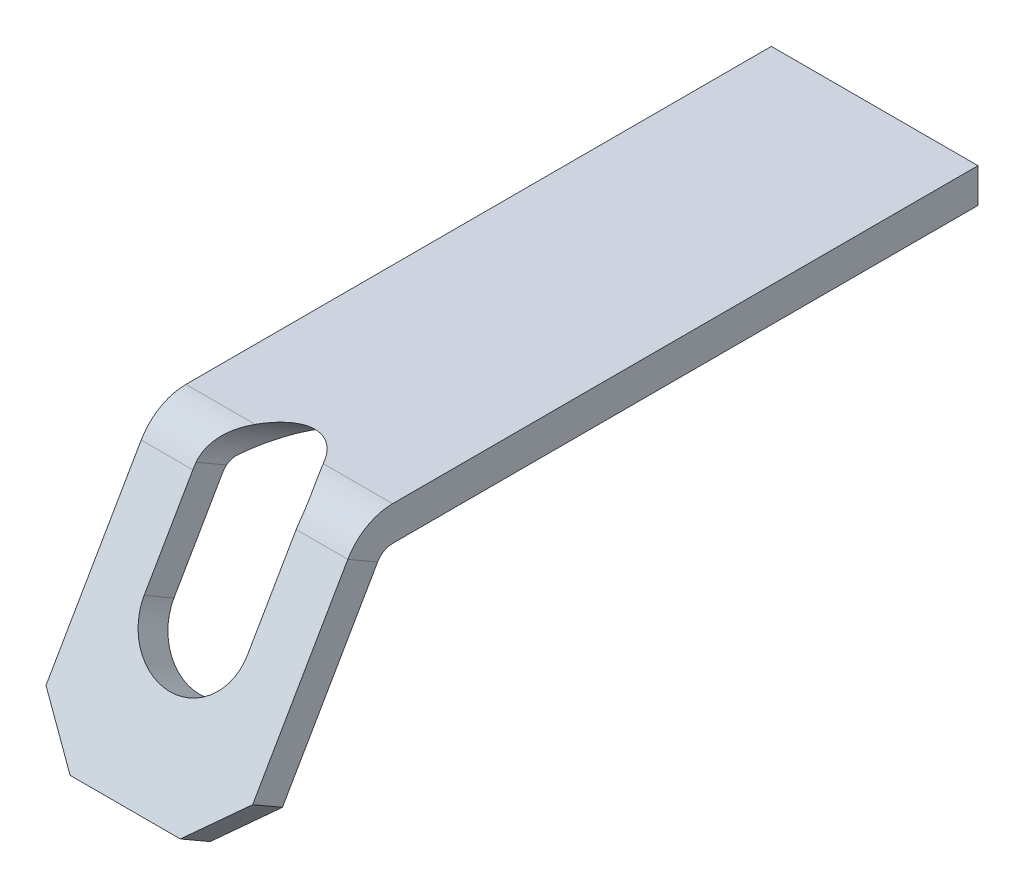
ISO-10303-21;
HEADER;
FILE_DESCRIPTION(('STEP AP214'),'2;1');
FILE_NAME('part.step','',(''),(''),'','','');
FILE_SCHEMA(('AUTOMOTIVE_DESIGN { 1 0 10303 214 1 1 1 1 }'));
ENDSEC;
DATA;
#1=APPLICATION_CONTEXT('core data for automotive mechanical design processes');
#2=APPLICATION_PROTOCOL_DEFINITION('international standard','automotive_design',2000,#1);
#3=PRODUCT_CONTEXT('',#1,'mechanical');
#4=PRODUCT('Part','Part','',(#3));
#5=PRODUCT_RELATED_PRODUCT_CATEGORY('part','',(#4));
#6=PRODUCT_DEFINITION_FORMATION('','',#4);
#7=PRODUCT_DEFINITION_CONTEXT('part definition',#1,'design');
#8=PRODUCT_DEFINITION('design','',#6,#7);
#9=PRODUCT_DEFINITION_SHAPE('','',#8);
#10=(LENGTH_UNIT() NAMED_UNIT(*) SI_UNIT(.MILLI.,.METRE.));
#11=(NAMED_UNIT(*) PLANE_ANGLE_UNIT() SI_UNIT($,.RADIAN.));
#12=(NAMED_UNIT(*) SI_UNIT($,.STERADIAN.) SOLID_ANGLE_UNIT());
#13=UNCERTAINTY_MEASURE_WITH_UNIT(LENGTH_MEASURE(1.E-05),#10,'distance_accuracy_value','');
#14=(GEOMETRIC_REPRESENTATION_CONTEXT(3) GLOBAL_UNCERTAINTY_ASSIGNED_CONTEXT((#13)) GLOBAL_UNIT_ASSIGNED_CONTEXT((#10,
#11,#12)) REPRESENTATION_CONTEXT('',''));
#15=CARTESIAN_POINT('',(0.,0.,0.));
#16=DIRECTION('',(0.,0.,1.));
#17=DIRECTION('',(1.,0.,0.));
#18=AXIS2_PLACEMENT_3D('',#15,#16,#17);
#19=CARTESIAN_POINT('',(0.,-0.5,4.25));
#20=DIRECTION('',(1.,0.,0.));
#21=DIRECTION('',(0.,0.,-1.));
#22=AXIS2_PLACEMENT_3D('',#19,#20,#21);
#23=CYLINDRICAL_SURFACE('',#22,0.25);
#24=CARTESIAN_POINT('',(0.738540154084688,-0.25,4.25));
#25=CARTESIAN_POINT('',(0.739796227190586,-0.249992222476748,4.26423192600012));
#26=CARTESIAN_POINT('',(0.741136393695474,-0.251215674942695,4.27845228618072));
#27=CARTESIAN_POINT('',(0.743704492818735,-0.255982139403662,4.30608304503192));
#28=CARTESIAN_POINT('',(0.74493454642555,-0.2594573169147,4.31950497559517));
#29=CARTESIAN_POINT('',(0.747172335123278,-0.268891956089954,4.34646595481917));
#30=CARTESIAN_POINT('',(0.748160348429003,-0.274998607282581,4.35995559261057));
#31=CARTESIAN_POINT('',(0.749588900459598,-0.289725386987503,4.38608332336731));
#32=CARTESIAN_POINT('',(0.750011148585141,-0.298418856822308,4.3986810266524));
#33=CARTESIAN_POINT('',(0.75,-0.308220009215909,4.41037591818866));
#34=B_SPLINE_CURVE_WITH_KNOTS('',3,(#24,#25,#26,#27,#28,#29,#30,#31,#32,#33),.UNSPECIFIED.,.F.,
.F.,(4,2,2,2,4),(0.,0.0428026914059938,0.0843723717900828,0.128652135829097,0.174331417159321),.UNSPECIFIED.);
#35=CARTESIAN_POINT('',(0.738540154084688,-0.25,4.25));
#36=VERTEX_POINT('',#35);
#37=CARTESIAN_POINT('',(0.75,-0.308220009215908,4.41037591818866));
#38=VERTEX_POINT('',#37);
#39=EDGE_CURVE('E317',#36,#38,#34,.T.);
#40=ORIENTED_EDGE('',*,*,#39,.F.);
#41=DIRECTION('',(1.,0.,0.));
#42=VECTOR('',#41,1.);
#43=CARTESIAN_POINT('',(-1.5,-0.25,4.25));
#44=LINE('',#43,#42);
#45=CARTESIAN_POINT('',(1.5,-0.25,4.25));
#46=VERTEX_POINT('',#45);
#47=EDGE_CURVE('E316',#36,#46,#44,.T.);
#48=ORIENTED_EDGE('',*,*,#47,.T.);
#49=CARTESIAN_POINT('',(1.5,-0.5,4.25));
#50=DIRECTION('',(1.,0.,0.));
#51=DIRECTION('',(0.,1.,0.));
#52=AXIS2_PLACEMENT_3D('',#49,#50,#51);
#53=CIRCLE('',#52,0.25);
#54=CARTESIAN_POINT('',(1.5,-0.375,4.46650635094611));
#55=VERTEX_POINT('',#54);
#56=EDGE_CURVE('E343',#46,#55,#53,.T.);
#57=ORIENTED_EDGE('',*,*,#56,.T.);
#58=DIRECTION('',(1.,0.,0.));
#59=VECTOR('',#58,1.);
#60=CARTESIAN_POINT('',(-1.5,-0.375,4.46650635094611));
#61=LINE('',#60,#59);
#62=CARTESIAN_POINT('',(0.75,-0.375,4.46650635094611));
#63=VERTEX_POINT('',#62);
#64=EDGE_CURVE('E332',#63,#55,#61,.T.);
#65=ORIENTED_EDGE('',*,*,#64,.F.);
#66=CARTESIAN_POINT('',(0.75,-0.5,4.25));
#67=DIRECTION('',(1.,0.,0.));
#68=DIRECTION('',(0.,0.,-1.));
#69=AXIS2_PLACEMENT_3D('',#66,#67,#68);
#70=CIRCLE('',#69,0.25);
#71=EDGE_CURVE('E203',#38,#63,#70,.T.);
#72=ORIENTED_EDGE('',*,*,#71,.F.);
#73=EDGE_LOOP('',(#40,#48,#57,#65,#72));
#74=FACE_BOUND('',#73,.T.);
#75=ADVANCED_FACE('F32',(#74),#23,.F.);
#76=CARTESIAN_POINT('',(0.,-0.5,4.25));
#77=DIRECTION('',(1.,0.,0.));
#78=DIRECTION('',(0.,0.,-1.));
#79=AXIS2_PLACEMENT_3D('',#76,#77,#78);
#80=CYLINDRICAL_SURFACE('',#79,0.75);
#81=CARTESIAN_POINT('',(0.75,-0.0530774463347981,4.85229580027208));
#82=CARTESIAN_POINT('',(0.750002475309161,-0.0390500007812527,4.84189012408484));
#83=CARTESIAN_POINT('',(0.749397484850658,-0.0253996458115997,4.83099771523583));
#84=CARTESIAN_POINT('',(0.747030547301498,0.00104006971930772,4.8083555069125));
#85=CARTESIAN_POINT('',(0.745269813605595,0.0138303177827564,4.79660661812892));
#86=CARTESIAN_POINT('',(0.738388136393959,0.0505308719127275,4.7604737016062));
#87=CARTESIAN_POINT('',(0.731665075692414,0.0730740166895009,4.73497676608455));
#88=CARTESIAN_POINT('',(0.714670479663492,0.113924752364809,4.68210224166803));
#89=CARTESIAN_POINT('',(0.704412929418581,0.132248568388786,4.65473240041221));
#90=CARTESIAN_POINT('',(0.681092480512217,0.164811508788652,4.59868326911695));
#91=CARTESIAN_POINT('',(0.668020265449992,0.179036692146175,4.56999988576025));
#92=CARTESIAN_POINT('',(0.63361768347433,0.2088635379017,4.49914580377907));
#93=CARTESIAN_POINT('',(0.611187373419911,0.222307050936848,4.45660414355653));
#94=CARTESIAN_POINT('',(0.564129396140941,0.241456718121171,4.37110856302409));
#95=CARTESIAN_POINT('',(0.539503361307708,0.247168570016325,4.3281549698181));
#96=CARTESIAN_POINT('',(0.508168812013807,0.249724148600028,4.27340370863223));
#97=CARTESIAN_POINT('',(0.501476538124168,0.249996949131605,4.26170462495713));
#98=CARTESIAN_POINT('',(0.494804752028709,0.250000000000006,4.25));
#99=B_SPLINE_CURVE_WITH_KNOTS('',3,(#81,#82,#83,#84,#85,#86,#87,#88,#89,#90,#91,#92,#93,#94,#95,
#96,#97,#98),.UNSPECIFIED.,.F.,.F.,(4,2,2,2,2,2,2,2,4),(0.,0.0523524240966635,0.104649972016483,
0.208128032232243,0.311201270134959,0.4146210689264,0.563636486235141,0.712542028697262,
0.752971410406567),.UNSPECIFIED.);
#100=CARTESIAN_POINT('',(0.75,-0.0530774463347985,4.85229580027207));
#101=VERTEX_POINT('',#100);
#102=CARTESIAN_POINT('',(0.494804752028707,0.25,4.25));
#103=VERTEX_POINT('',#102);
#104=EDGE_CURVE('E242',#101,#103,#99,.T.);
#105=ORIENTED_EDGE('',*,*,#104,.F.);
#106=CARTESIAN_POINT('',(0.75,-0.5,4.25));
#107=DIRECTION('',(1.,0.,0.));
#108=DIRECTION('',(0.,0.,-1.));
#109=AXIS2_PLACEMENT_3D('',#106,#107,#108);
#110=CIRCLE('',#109,0.75);
#111=CARTESIAN_POINT('',(0.75,-0.125000000000001,4.89951905283833));
#112=VERTEX_POINT('',#111);
#113=EDGE_CURVE('E205',#112,#101,#110,.F.);
#114=ORIENTED_EDGE('',*,*,#113,.F.);
#115=DIRECTION('',(-1.,0.,0.));
#116=VECTOR('',#115,1.);
#117=CARTESIAN_POINT('',(1.5,-0.125000000000001,4.89951905283833));
#118=LINE('',#117,#116);
#119=CARTESIAN_POINT('',(1.5,-0.125000000000001,4.89951905283833));
#120=VERTEX_POINT('',#119);
#121=EDGE_CURVE('E340',#120,#112,#118,.T.);
#122=ORIENTED_EDGE('',*,*,#121,.F.);
#123=CARTESIAN_POINT('',(1.5,-0.5,4.25));
#124=DIRECTION('',(1.,0.,0.));
#125=DIRECTION('',(0.,1.,0.));
#126=AXIS2_PLACEMENT_3D('',#123,#124,#125);
#127=CIRCLE('',#126,0.75);
#128=CARTESIAN_POINT('',(1.5,0.25,4.25));
#129=VERTEX_POINT('',#128);
#130=EDGE_CURVE('E354',#129,#120,#127,.T.);
#131=ORIENTED_EDGE('',*,*,#130,.F.);
#132=DIRECTION('',(1.,0.,0.));
#133=VECTOR('',#132,1.);
#134=CARTESIAN_POINT('',(-1.5,0.25,4.25));
#135=LINE('',#134,#133);
#136=EDGE_CURVE('E371',#103,#129,#135,.T.);
#137=ORIENTED_EDGE('',*,*,#136,.F.);
#138=EDGE_LOOP('',(#105,#114,#122,#131,#137));
#139=FACE_BOUND('',#138,.T.);
#140=ADVANCED_FACE('F256',(#139),#80,.T.);
#141=CARTESIAN_POINT('',(1.5,0.25,-4.25));
#142=DIRECTION('',(-1.,0.,0.));
#143=DIRECTION('',(0.,0.,1.));
#144=AXIS2_PLACEMENT_3D('',#141,#142,#143);
#145=PLANE('',#144);
#146=DIRECTION('',(0.,0.,-1.));
#147=VECTOR('',#146,1.);
#148=CARTESIAN_POINT('',(1.5,-0.25,-4.25));
#149=LINE('',#148,#147);
#150=CARTESIAN_POINT('',(1.5,-0.25,-4.25));
#151=VERTEX_POINT('',#150);
#152=EDGE_CURVE('E363',#46,#151,#149,.T.);
#153=ORIENTED_EDGE('',*,*,#152,.T.);
#154=DIRECTION('',(0.,-1.,0.));
#155=VECTOR('',#154,1.);
#156=CARTESIAN_POINT('',(1.5,0.25,-4.25));
#157=LINE('',#156,#155);
#158=CARTESIAN_POINT('',(1.5,0.25,-4.25));
#159=VERTEX_POINT('',#158);
#160=EDGE_CURVE('E181',#159,#151,#157,.T.);
#161=ORIENTED_EDGE('',*,*,#160,.F.);
#162=DIRECTION('',(0.,0.,-1.));
#163=VECTOR('',#162,1.);
#164=CARTESIAN_POINT('',(1.5,0.25,-4.25));
#165=LINE('',#164,#163);
#166=EDGE_CURVE('E364',#129,#159,#165,.T.);
#167=ORIENTED_EDGE('',*,*,#166,.F.);
#168=ORIENTED_EDGE('',*,*,#130,.T.);
#169=DIRECTION('',(0.,0.5,0.866025403784439));
#170=VECTOR('',#169,1.);
#171=CARTESIAN_POINT('',(1.5,-0.375,4.46650635094611));
#172=LINE('',#171,#170);
#173=EDGE_CURVE('E346',#55,#120,#172,.T.);
#174=ORIENTED_EDGE('',*,*,#173,.F.);
#175=ORIENTED_EDGE('',*,*,#56,.F.);
#176=EDGE_LOOP('',(#153,#161,#167,#168,#174,#175));
#177=FACE_BOUND('',#176,.T.);
#178=ADVANCED_FACE('F279',(#177),#145,.F.);
#179=CARTESIAN_POINT('',(-1.5,0.25,-4.25));
#180=DIRECTION('',(0.,0.,1.));
#181=DIRECTION('',(1.,0.,0.));
#182=AXIS2_PLACEMENT_3D('',#179,#180,#181);
#183=PLANE('',#182);
#184=DIRECTION('',(-1.,0.,0.));
#185=VECTOR('',#184,1.);
#186=CARTESIAN_POINT('',(-1.5,-0.25,-4.25));
#187=LINE('',#186,#185);
#188=CARTESIAN_POINT('',(-1.5,-0.25,-4.25));
#189=VERTEX_POINT('',#188);
#190=EDGE_CURVE('E378',#151,#189,#187,.T.);
#191=ORIENTED_EDGE('',*,*,#190,.T.);
#192=DIRECTION('',(0.,-1.,0.));
#193=VECTOR('',#192,1.);
#194=CARTESIAN_POINT('',(-1.5,0.25,-4.25));
#195=LINE('',#194,#193);
#196=CARTESIAN_POINT('',(-1.5,0.25,-4.25));
#197=VERTEX_POINT('',#196);
#198=EDGE_CURVE('E375',#197,#189,#195,.T.);
#199=ORIENTED_EDGE('',*,*,#198,.F.);
#200=DIRECTION('',(-1.,0.,0.));
#201=VECTOR('',#200,1.);
#202=CARTESIAN_POINT('',(-1.5,0.25,-4.25));
#203=LINE('',#202,#201);
#204=EDGE_CURVE('E367',#159,#197,#203,.T.);
#205=ORIENTED_EDGE('',*,*,#204,.F.);
#206=ORIENTED_EDGE('',*,*,#160,.T.);
#207=EDGE_LOOP('',(#191,#199,#205,#206));
#208=FACE_BOUND('',#207,.T.);
#209=ADVANCED_FACE('F275',(#208),#183,.F.);
#210=CARTESIAN_POINT('',(-1.5,0.25,-4.25));
#211=DIRECTION('',(1.,0.,0.));
#212=DIRECTION('',(0.,0.,-1.));
#213=AXIS2_PLACEMENT_3D('',#210,#211,#212);
#214=PLANE('',#213);
#215=DIRECTION('',(0.,0.,1.));
#216=VECTOR('',#215,1.);
#217=CARTESIAN_POINT('',(-1.5,-0.25,-4.25));
#218=LINE('',#217,#216);
#219=CARTESIAN_POINT('',(-1.5,-0.25,4.25));
#220=VERTEX_POINT('',#219);
#221=EDGE_CURVE('E380',#189,#220,#218,.T.);
#222=ORIENTED_EDGE('',*,*,#221,.T.);
#223=CARTESIAN_POINT('',(-1.5,-0.5,4.25));
#224=DIRECTION('',(1.,0.,0.));
#225=DIRECTION('',(0.,1.,0.));
#226=AXIS2_PLACEMENT_3D('',#223,#224,#225);
#227=CIRCLE('',#226,0.25);
#228=CARTESIAN_POINT('',(-1.5,-0.375,4.46650635094611));
#229=VERTEX_POINT('',#228);
#230=EDGE_CURVE('E330',#220,#229,#227,.T.);
#231=ORIENTED_EDGE('',*,*,#230,.T.);
#232=DIRECTION('',(0.,-0.5,-0.866025403784439));
#233=VECTOR('',#232,1.);
#234=CARTESIAN_POINT('',(-1.5,-0.125000000000001,4.89951905283833));
#235=LINE('',#234,#233);
#236=CARTESIAN_POINT('',(-1.5,-0.125000000000001,4.89951905283833));
#237=VERTEX_POINT('',#236);
#238=EDGE_CURVE('E321',#237,#229,#235,.T.);
#239=ORIENTED_EDGE('',*,*,#238,.F.);
#240=CARTESIAN_POINT('',(-1.5,-0.5,4.25));
#241=DIRECTION('',(1.,0.,0.));
#242=DIRECTION('',(0.,1.,0.));
#243=AXIS2_PLACEMENT_3D('',#240,#241,#242);
#244=CIRCLE('',#243,0.75);
#245=CARTESIAN_POINT('',(-1.5,0.25,4.25));
#246=VERTEX_POINT('',#245);
#247=EDGE_CURVE('E318',#246,#237,#244,.T.);
#248=ORIENTED_EDGE('',*,*,#247,.F.);
#249=DIRECTION('',(0.,0.,1.));
#250=VECTOR('',#249,1.);
#251=CARTESIAN_POINT('',(-1.5,0.25,-4.25));
#252=LINE('',#251,#250);
#253=EDGE_CURVE('E369',#197,#246,#252,.T.);
#254=ORIENTED_EDGE('',*,*,#253,.F.);
#255=ORIENTED_EDGE('',*,*,#198,.T.);
#256=EDGE_LOOP('',(#222,#231,#239,#248,#254,#255));
#257=FACE_BOUND('',#256,.T.);
#258=ADVANCED_FACE('F268',(#257),#214,.F.);
#259=CARTESIAN_POINT('',(0.,0.25,0.));
#260=DIRECTION('',(0.,1.,0.));
#261=DIRECTION('',(0.,0.,1.));
#262=AXIS2_PLACEMENT_3D('',#259,#260,#261);
#263=PLANE('',#262);
#264=CARTESIAN_POINT('',(0.,0.25,5.37724133595217));
#265=DIRECTION('',(0.,1.,0.));
#266=DIRECTION('',(0.,0.,1.));
#267=AXIS2_PLACEMENT_3D('',#264,#265,#266);
#268=ELLIPSE('',#267,1.5,0.75);
#269=CARTESIAN_POINT('',(-0.494804752028707,0.25,4.25));
#270=VERTEX_POINT('',#269);
#271=EDGE_CURVE('E207',#103,#270,#268,.T.);
#272=ORIENTED_EDGE('',*,*,#271,.F.);
#273=ORIENTED_EDGE('',*,*,#136,.T.);
#274=ORIENTED_EDGE('',*,*,#166,.T.);
#275=ORIENTED_EDGE('',*,*,#204,.T.);
#276=ORIENTED_EDGE('',*,*,#253,.T.);
#277=EDGE_CURVE('E372',#246,#270,#135,.T.);
#278=ORIENTED_EDGE('',*,*,#277,.T.);
#279=EDGE_LOOP('',(#272,#273,#274,#275,#276,#278));
#280=FACE_BOUND('',#279,.T.);
#281=ADVANCED_FACE('F265',(#280),#263,.T.);
#282=CARTESIAN_POINT('',(0.,-0.25,0.));
#283=DIRECTION('',(0.,1.,0.));
#284=DIRECTION('',(0.,0.,1.));
#285=AXIS2_PLACEMENT_3D('',#282,#283,#284);
#286=PLANE('',#285);
#287=ORIENTED_EDGE('',*,*,#47,.F.);
#288=CARTESIAN_POINT('',(0.,-0.25,4.51121593216774));
#289=DIRECTION('',(0.,1.,0.));
#290=DIRECTION('',(0.,0.,1.));
#291=AXIS2_PLACEMENT_3D('',#288,#289,#290);
#292=ELLIPSE('',#291,1.5,0.75);
#293=CARTESIAN_POINT('',(-0.738540154084688,-0.25,4.25));
#294=VERTEX_POINT('',#293);
#295=EDGE_CURVE('E217',#36,#294,#292,.T.);
#296=ORIENTED_EDGE('',*,*,#295,.T.);
#297=EDGE_CURVE('E309',#220,#294,#44,.T.);
#298=ORIENTED_EDGE('',*,*,#297,.F.);
#299=ORIENTED_EDGE('',*,*,#221,.F.);
#300=ORIENTED_EDGE('',*,*,#190,.F.);
#301=ORIENTED_EDGE('',*,*,#152,.F.);
#302=EDGE_LOOP('',(#287,#296,#298,#299,#300,#301));
#303=FACE_BOUND('',#302,.T.);
#304=ADVANCED_FACE('F261',(#303),#286,.F.);
#305=CARTESIAN_POINT('',(0.,-3.25,6.4150635094611));
#306=DIRECTION('',(0.,-0.866025403784438,0.500000000000001));
#307=DIRECTION('',(1.,0.,0.));
#308=AXIS2_PLACEMENT_3D('',#305,#306,#307);
#309=PLANE('',#308);
#310=DIRECTION('',(1.,0.,0.));
#311=VECTOR('',#310,1.);
#312=CARTESIAN_POINT('',(-1.5,-3.375,6.198557158515));
#313=LINE('',#312,#311);
#314=CARTESIAN_POINT('',(-0.799999999999998,-3.375,6.198557158515));
#315=VERTEX_POINT('',#314);
#316=CARTESIAN_POINT('',(0.8,-3.375,6.198557158515));
#317=VERTEX_POINT('',#316);
#318=EDGE_CURVE('E336',#315,#317,#313,.T.);
#319=ORIENTED_EDGE('',*,*,#318,.T.);
#320=DIRECTION('',(0.,0.500000000000001,0.866025403784438));
#321=VECTOR('',#320,1.);
#322=CARTESIAN_POINT('',(0.8,-3.25,6.4150635094611));
#323=LINE('',#322,#321);
#324=CARTESIAN_POINT('',(0.8,-3.125,6.63156986040721));
#325=VERTEX_POINT('',#324);
#326=EDGE_CURVE('E402',#317,#325,#323,.T.);
#327=ORIENTED_EDGE('',*,*,#326,.T.);
#328=DIRECTION('',(-1.,0.,0.));
#329=VECTOR('',#328,1.);
#330=CARTESIAN_POINT('',(1.5,-3.125,6.63156986040721));
#331=LINE('',#330,#329);
#332=CARTESIAN_POINT('',(-0.799999999999998,-3.125,6.63156986040721));
#333=VERTEX_POINT('',#332);
#334=EDGE_CURVE('E359',#325,#333,#331,.T.);
#335=ORIENTED_EDGE('',*,*,#334,.T.);
#336=DIRECTION('',(0.,-0.500000000000001,-0.866025403784438));
#337=VECTOR('',#336,1.);
#338=CARTESIAN_POINT('',(-0.799999999999998,-3.25,6.4150635094611));
#339=LINE('',#338,#337);
#340=EDGE_CURVE('E248',#333,#315,#339,.T.);
#341=ORIENTED_EDGE('',*,*,#340,.T.);
#342=EDGE_LOOP('',(#319,#327,#335,#341));
#343=FACE_BOUND('',#342,.T.);
#344=ADVANCED_FACE('F229',(#343),#309,.T.);
#345=CARTESIAN_POINT('',(-0.75,-0.308220009215908,4.41037591818866));
#346=CARTESIAN_POINT('',(-0.750008310530121,-0.299170345690206,4.39957110118343));
#347=CARTESIAN_POINT('',(-0.7496493719506,-0.291061551564701,4.38799997393136));
#348=CARTESIAN_POINT('',(-0.748415678099862,-0.277104423632904,4.36403100034418));
#349=CARTESIAN_POINT('',(-0.747555891577427,-0.271198332145317,4.35166604883466));
#350=CARTESIAN_POINT('',(-0.745421239101967,-0.261037124809497,4.32496342703673));
#351=CARTESIAN_POINT('',(-0.744115010283401,-0.256988760900442,4.31054949871758));
#352=CARTESIAN_POINT('',(-0.741355473168162,-0.25142101625551,4.28077071335262));
#353=CARTESIAN_POINT('',(-0.739898791250124,-0.249986913345264,4.26539018443887));
#354=CARTESIAN_POINT('',(-0.738540154084688,-0.25,4.25));
#355=B_SPLINE_CURVE_WITH_KNOTS('',3,(#345,#346,#347,#348,#349,#350,#351,#352,#353,#354),
.UNSPECIFIED.,.F.,.F.,(4,2,2,2,4),(0.,0.0422016336722642,0.0832023760305246,0.128047888733355,
0.174331752280167),.UNSPECIFIED.);
#356=CARTESIAN_POINT('',(-0.75,-0.308220009215908,4.41037591818866));
#357=VERTEX_POINT('',#356);
#358=EDGE_CURVE('E209',#357,#294,#355,.T.);
#359=ORIENTED_EDGE('',*,*,#358,.F.);
#360=CARTESIAN_POINT('',(-0.75,-0.5,4.25));
#361=DIRECTION('',(-1.,0.,0.));
#362=DIRECTION('',(0.,-1.,0.));
#363=AXIS2_PLACEMENT_3D('',#360,#361,#362);
#364=CIRCLE('',#363,0.25);
#365=CARTESIAN_POINT('',(-0.75,-0.375,4.46650635094611));
#366=VERTEX_POINT('',#365);
#367=EDGE_CURVE('E197',#366,#357,#364,.T.);
#368=ORIENTED_EDGE('',*,*,#367,.F.);
#369=EDGE_CURVE('E341',#229,#366,#61,.T.);
#370=ORIENTED_EDGE('',*,*,#369,.F.);
#371=ORIENTED_EDGE('',*,*,#230,.F.);
#372=ORIENTED_EDGE('',*,*,#297,.T.);
#373=EDGE_LOOP('',(#359,#368,#370,#371,#372));
#374=FACE_BOUND('',#373,.T.);
#375=ADVANCED_FACE('F219',(#374),#23,.F.);
#376=CARTESIAN_POINT('',(-0.494804752028707,0.25,4.25));
#377=CARTESIAN_POINT('',(-0.507212223849995,0.24999104936502,4.27176544478382));
#378=CARTESIAN_POINT('',(-0.519677329562981,0.249052174133644,4.29348153759597));
#379=CARTESIAN_POINT('',(-0.544476505895984,0.245273819176751,4.33686353730328));
#380=CARTESIAN_POINT('',(-0.556810364065535,0.242431628285439,4.35852932830796));
#381=CARTESIAN_POINT('',(-0.593492984985001,0.230897623169133,4.42397071088134));
#382=CARTESIAN_POINT('',(-0.617199549117097,0.219196023208876,4.46764754407431));
#383=CARTESIAN_POINT('',(-0.655369353049871,0.191156681794535,4.54326612847591));
#384=CARTESIAN_POINT('',(-0.670675057728904,0.176653514513336,4.57546468892482));
#385=CARTESIAN_POINT('',(-0.697958612412823,0.142647605295805,4.63828922937357));
#386=CARTESIAN_POINT('',(-0.70996212874235,0.123185827280292,4.66892573721418));
#387=CARTESIAN_POINT('',(-0.729340509733132,0.0800406667948656,4.72675752132392));
#388=CARTESIAN_POINT('',(-0.736878604418717,0.0565530386505959,4.75404068185705));
#389=CARTESIAN_POINT('',(-0.744635583122395,0.0179834450445735,4.79270929564723));
#390=CARTESIAN_POINT('',(-0.746630830911752,0.00444936512402553,4.80531366677174));
#391=CARTESIAN_POINT('',(-0.749315579530813,-0.0236048687245404,4.82956257178275));
#392=CARTESIAN_POINT('',(-0.750003338619623,-0.0381263113268377,4.84120580560175));
#393=CARTESIAN_POINT('',(-0.75,-0.0530774463347993,4.85229580027208));
#394=B_SPLINE_CURVE_WITH_KNOTS('',3,(#376,#377,#378,#379,#380,#381,#382,#383,#384,#385,#386,
#387,#388,#389,#390,#391,#392,#393),.UNSPECIFIED.,.F.,.F.,(4,2,2,2,2,2,2,2,4),(0.,
0.0751135104377852,0.150334244069228,0.302651785589941,0.417705443137115,0.531837811097346,
0.641489009411778,0.697207014432039,0.752999191038594),.UNSPECIFIED.);
#395=CARTESIAN_POINT('',(-0.75,-0.0530774463347985,4.85229580027207));
#396=VERTEX_POINT('',#395);
#397=EDGE_CURVE('E180',#270,#396,#394,.T.);
#398=ORIENTED_EDGE('',*,*,#397,.F.);
#399=ORIENTED_EDGE('',*,*,#277,.F.);
#400=ORIENTED_EDGE('',*,*,#247,.T.);
#401=CARTESIAN_POINT('',(-0.75,-0.125000000000001,4.89951905283833));
#402=VERTEX_POINT('',#401);
#403=EDGE_CURVE('E357',#402,#237,#118,.T.);
#404=ORIENTED_EDGE('',*,*,#403,.F.);
#405=CARTESIAN_POINT('',(-0.75,-0.5,4.25));
#406=DIRECTION('',(-1.,0.,0.));
#407=DIRECTION('',(0.,-1.,0.));
#408=AXIS2_PLACEMENT_3D('',#405,#406,#407);
#409=CIRCLE('',#408,0.75);
#410=EDGE_CURVE('E177',#396,#402,#409,.F.);
#411=ORIENTED_EDGE('',*,*,#410,.F.);
#412=EDGE_LOOP('',(#398,#399,#400,#404,#411));
#413=FACE_BOUND('',#412,.T.);
#414=ADVANCED_FACE('F250',(#413),#80,.T.);
#415=CARTESIAN_POINT('',(-1.5,-0.125,4.89951905283833));
#416=DIRECTION('',(-1.,0.,0.));
#417=DIRECTION('',(0.,0.,1.));
#418=AXIS2_PLACEMENT_3D('',#415,#416,#417);
#419=PLANE('',#418);
#420=DIRECTION('',(0.,-0.866025403784438,0.500000000000001));
#421=VECTOR('',#420,1.);
#422=CARTESIAN_POINT('',(-1.5,-0.375,4.46650635094611));
#423=LINE('',#422,#421);
#424=CARTESIAN_POINT('',(-1.5,-2.76878221735089,5.84855715851499));
#425=VERTEX_POINT('',#424);
#426=EDGE_CURVE('E334',#229,#425,#423,.T.);
#427=ORIENTED_EDGE('',*,*,#426,.T.);
#428=DIRECTION('',(0.,0.500000000000001,0.866025403784438));
#429=VECTOR('',#428,1.);
#430=CARTESIAN_POINT('',(-1.5,-2.51878221735089,6.28156986040721));
#431=LINE('',#430,#429);
#432=CARTESIAN_POINT('',(-1.5,-2.51878221735089,6.28156986040721));
#433=VERTEX_POINT('',#432);
#434=EDGE_CURVE('E11',#425,#433,#431,.T.);
#435=ORIENTED_EDGE('',*,*,#434,.T.);
#436=DIRECTION('',(0.,-0.866025403784438,0.500000000000001));
#437=VECTOR('',#436,1.);
#438=CARTESIAN_POINT('',(-1.5,-0.125,4.89951905283833));
#439=LINE('',#438,#437);
#440=EDGE_CURVE('E337',#237,#433,#439,.T.);
#441=ORIENTED_EDGE('',*,*,#440,.F.);
#442=ORIENTED_EDGE('',*,*,#238,.T.);
#443=EDGE_LOOP('',(#427,#435,#441,#442));
#444=FACE_BOUND('',#443,.T.);
#445=ADVANCED_FACE('F231',(#444),#419,.T.);
#446=CARTESIAN_POINT('',(-1.5,-0.375,4.46650635094611));
#447=DIRECTION('',(0.,-0.500000000000001,-0.866025403784438));
#448=DIRECTION('',(0.,0.866025403784438,-0.500000000000001));
#449=AXIS2_PLACEMENT_3D('',#446,#447,#448);
#450=PLANE('',#449);
#451=DIRECTION('',(0.,-0.866025403784438,0.500000000000001));
#452=VECTOR('',#451,1.);
#453=CARTESIAN_POINT('',(1.5,-0.375,4.46650635094611));
#454=LINE('',#453,#452);
#455=CARTESIAN_POINT('',(1.5,-2.76878221735089,5.84855715851499));
#456=VERTEX_POINT('',#455);
#457=EDGE_CURVE('E349',#55,#456,#454,.T.);
#458=ORIENTED_EDGE('',*,*,#457,.T.);
#459=DIRECTION('',(0.707106781186546,0.612372435695796,-0.353553390593275));
#460=VECTOR('',#459,1.);
#461=CARTESIAN_POINT('',(1.38205080756888,-2.8709292143521,5.90753175473055));
#462=LINE('',#461,#460);
#463=EDGE_CURVE('E40',#456,#317,#462,.F.);
#464=ORIENTED_EDGE('',*,*,#463,.T.);
#465=ORIENTED_EDGE('',*,*,#318,.F.);
#466=DIRECTION('',(0.707106781186546,-0.612372435695796,0.353553390593275));
#467=VECTOR('',#466,1.);
#468=CARTESIAN_POINT('',(-2.88205080756888,-1.57189110867544,5.15753175473055));
#469=LINE('',#468,#467);
#470=EDGE_CURVE('E47',#315,#425,#469,.F.);
#471=ORIENTED_EDGE('',*,*,#470,.T.);
#472=ORIENTED_EDGE('',*,*,#426,.F.);
#473=ORIENTED_EDGE('',*,*,#369,.T.);
#474=DIRECTION('',(0.,0.866025403784438,-0.500000000000001));
#475=VECTOR('',#474,1.);
#476=CARTESIAN_POINT('',(-0.75,-0.375,4.46650635094611));
#477=LINE('',#476,#475);
#478=CARTESIAN_POINT('',(-0.75,-1.5996479222419,5.17355715851499));
#479=VERTEX_POINT('',#478);
#480=EDGE_CURVE('E193',#479,#366,#477,.T.);
#481=ORIENTED_EDGE('',*,*,#480,.F.);
#482=CARTESIAN_POINT('',(0.,-1.5996479222419,5.17355715851499));
#483=DIRECTION('',(0.,-0.500000000000001,-0.866025403784438));
#484=DIRECTION('',(0.,0.866025403784438,-0.500000000000001));
#485=AXIS2_PLACEMENT_3D('',#482,#483,#484);
#486=CIRCLE('',#485,0.75);
#487=CARTESIAN_POINT('',(0.75,-1.5996479222419,5.17355715851499));
#488=VERTEX_POINT('',#487);
#489=EDGE_CURVE('E166',#488,#479,#486,.T.);
#490=ORIENTED_EDGE('',*,*,#489,.F.);
#491=DIRECTION('',(0.,-0.866025403784438,0.500000000000001));
#492=VECTOR('',#491,1.);
#493=CARTESIAN_POINT('',(0.75,-0.375,4.46650635094611));
#494=LINE('',#493,#492);
#495=EDGE_CURVE('E201',#63,#488,#494,.T.);
#496=ORIENTED_EDGE('',*,*,#495,.F.);
#497=ORIENTED_EDGE('',*,*,#64,.T.);
#498=EDGE_LOOP('',(#458,#464,#465,#471,#472,#473,#481,#490,#496,#497));
#499=FACE_BOUND('',#498,.T.);
#500=ADVANCED_FACE('F393',(#499),#450,.T.);
#501=CARTESIAN_POINT('',(1.5,-0.375,4.46650635094611));
#502=DIRECTION('',(1.,0.,0.));
#503=DIRECTION('',(0.,0.,-1.));
#504=AXIS2_PLACEMENT_3D('',#501,#502,#503);
#505=PLANE('',#504);
#506=DIRECTION('',(0.,-0.866025403784438,0.500000000000001));
#507=VECTOR('',#506,1.);
#508=CARTESIAN_POINT('',(1.5,-0.125,4.89951905283833));
#509=LINE('',#508,#507);
#510=CARTESIAN_POINT('',(1.5,-2.51878221735089,6.28156986040721));
#511=VERTEX_POINT('',#510);
#512=EDGE_CURVE('E351',#120,#511,#509,.T.);
#513=ORIENTED_EDGE('',*,*,#512,.T.);
#514=DIRECTION('',(0.,-0.500000000000001,-0.866025403784438));
#515=VECTOR('',#514,1.);
#516=CARTESIAN_POINT('',(1.5,-2.76878221735089,5.84855715851499));
#517=LINE('',#516,#515);
#518=EDGE_CURVE('E55',#511,#456,#517,.T.);
#519=ORIENTED_EDGE('',*,*,#518,.T.);
#520=ORIENTED_EDGE('',*,*,#457,.F.);
#521=ORIENTED_EDGE('',*,*,#173,.T.);
#522=EDGE_LOOP('',(#513,#519,#520,#521));
#523=FACE_BOUND('',#522,.T.);
#524=ADVANCED_FACE('F257',(#523),#505,.T.);
#525=CARTESIAN_POINT('',(1.5,-0.125,4.89951905283833));
#526=DIRECTION('',(0.,0.500000000000001,0.866025403784438));
#527=DIRECTION('',(0.,-0.866025403784438,0.500000000000001));
#528=AXIS2_PLACEMENT_3D('',#525,#526,#527);
#529=PLANE('',#528);
#530=ORIENTED_EDGE('',*,*,#334,.F.);
#531=DIRECTION('',(-0.707106781186546,-0.612372435695796,0.353553390593275));
#532=VECTOR('',#531,1.);
#533=CARTESIAN_POINT('',(2.88205080756888,-1.32189110867544,5.59054445662277));
#534=LINE('',#533,#532);
#535=EDGE_CURVE('E401',#325,#511,#534,.F.);
#536=ORIENTED_EDGE('',*,*,#535,.T.);
#537=ORIENTED_EDGE('',*,*,#512,.F.);
#538=ORIENTED_EDGE('',*,*,#121,.T.);
#539=DIRECTION('',(0.,0.866025403784438,-0.500000000000001));
#540=VECTOR('',#539,1.);
#541=CARTESIAN_POINT('',(0.75,-0.0506098165652452,4.85656986040721));
#542=LINE('',#541,#540);
#543=CARTESIAN_POINT('',(0.75,-1.3496479222419,5.60656986040721));
#544=VERTEX_POINT('',#543);
#545=EDGE_CURVE('E186',#544,#112,#542,.T.);
#546=ORIENTED_EDGE('',*,*,#545,.F.);
#547=CARTESIAN_POINT('',(0.,-1.3496479222419,5.60656986040721));
#548=DIRECTION('',(0.,0.500000000000001,0.866025403784438));
#549=DIRECTION('',(0.,-0.866025403784438,0.500000000000001));
#550=AXIS2_PLACEMENT_3D('',#547,#548,#549);
#551=CIRCLE('',#550,0.75);
#552=CARTESIAN_POINT('',(-0.75,-1.3496479222419,5.60656986040721));
#553=VERTEX_POINT('',#552);
#554=EDGE_CURVE('E163',#553,#544,#551,.T.);
#555=ORIENTED_EDGE('',*,*,#554,.F.);
#556=DIRECTION('',(0.,-0.866025403784438,0.500000000000001));
#557=VECTOR('',#556,1.);
#558=CARTESIAN_POINT('',(-0.75,-0.125,4.89951905283833));
#559=LINE('',#558,#557);
#560=EDGE_CURVE('E173',#402,#553,#559,.T.);
#561=ORIENTED_EDGE('',*,*,#560,.F.);
#562=ORIENTED_EDGE('',*,*,#403,.T.);
#563=ORIENTED_EDGE('',*,*,#440,.T.);
#564=DIRECTION('',(-0.707106781186546,0.612372435695796,-0.353553390593275));
#565=VECTOR('',#564,1.);
#566=CARTESIAN_POINT('',(-1.38205080756888,-2.6209292143521,6.34054445662277));
#567=LINE('',#566,#565);
#568=EDGE_CURVE('E400',#433,#333,#567,.F.);
#569=ORIENTED_EDGE('',*,*,#568,.T.);
#570=EDGE_LOOP('',(#530,#536,#537,#538,#546,#555,#561,#562,#563,#569));
#571=FACE_BOUND('',#570,.T.);
#572=ADVANCED_FACE('F184',(#571),#529,.T.);
#573=CARTESIAN_POINT('',(0.,-4.82496778264912,-3.41286071037125));
#574=DIRECTION('',(0.,0.500000000000001,0.866025403784438));
#575=DIRECTION('',(0.,-0.866025403784438,0.500000000000001));
#576=AXIS2_PLACEMENT_3D('',#573,#574,#575);
#577=CYLINDRICAL_SURFACE('',#576,0.75);
#578=ORIENTED_EDGE('',*,*,#39,.T.);
#579=DIRECTION('',(0.,0.500000000000001,0.866025403784438));
#580=VECTOR('',#579,1.);
#581=CARTESIAN_POINT('',(0.75,-4.82496778264912,-3.41286071037125));
#582=LINE('',#581,#580);
#583=EDGE_CURVE('E190',#38,#101,#582,.T.);
#584=ORIENTED_EDGE('',*,*,#583,.T.);
#585=ORIENTED_EDGE('',*,*,#104,.T.);
#586=ORIENTED_EDGE('',*,*,#271,.T.);
#587=ORIENTED_EDGE('',*,*,#397,.T.);
#588=DIRECTION('',(0.,0.500000000000001,0.866025403784438));
#589=VECTOR('',#588,1.);
#590=CARTESIAN_POINT('',(-0.75,-4.82496778264912,-3.41286071037125));
#591=LINE('',#590,#589);
#592=EDGE_CURVE('E170',#357,#396,#591,.T.);
#593=ORIENTED_EDGE('',*,*,#592,.F.);
#594=ORIENTED_EDGE('',*,*,#358,.T.);
#595=ORIENTED_EDGE('',*,*,#295,.F.);
#596=EDGE_LOOP('',(#578,#584,#585,#586,#587,#593,#594,#595));
#597=FACE_BOUND('',#596,.T.);
#598=ADVANCED_FACE('F223',(#597),#577,.F.);
#599=CARTESIAN_POINT('',(0.75,-4.82496778264912,-3.41286071037125));
#600=DIRECTION('',(1.,0.,0.));
#601=DIRECTION('',(0.,0.,-1.));
#602=AXIS2_PLACEMENT_3D('',#599,#600,#601);
#603=PLANE('',#602);
#604=ORIENTED_EDGE('',*,*,#113,.T.);
#605=ORIENTED_EDGE('',*,*,#583,.F.);
#606=ORIENTED_EDGE('',*,*,#71,.T.);
#607=ORIENTED_EDGE('',*,*,#495,.T.);
#608=DIRECTION('',(0.,0.500000000000001,0.866025403784438));
#609=VECTOR('',#608,1.);
#610=CARTESIAN_POINT('',(0.75,-6.12400588832578,-2.66286071037124));
#611=LINE('',#610,#609);
#612=EDGE_CURVE('E169',#488,#544,#611,.T.);
#613=ORIENTED_EDGE('',*,*,#612,.T.);
#614=ORIENTED_EDGE('',*,*,#545,.T.);
#615=EDGE_LOOP('',(#604,#605,#606,#607,#613,#614));
#616=FACE_BOUND('',#615,.T.);
#617=ADVANCED_FACE('F227',(#616),#603,.F.);
#618=CARTESIAN_POINT('',(0.,-6.12400588832578,-2.66286071037124));
#619=DIRECTION('',(0.,0.500000000000001,0.866025403784438));
#620=DIRECTION('',(0.,-0.866025403784438,0.500000000000001));
#621=AXIS2_PLACEMENT_3D('',#618,#619,#620);
#622=CYLINDRICAL_SURFACE('',#621,0.75);
#623=ORIENTED_EDGE('',*,*,#489,.T.);
#624=DIRECTION('',(0.,0.500000000000001,0.866025403784438));
#625=VECTOR('',#624,1.);
#626=CARTESIAN_POINT('',(-0.75,-6.12400588832578,-2.66286071037124));
#627=LINE('',#626,#625);
#628=EDGE_CURVE('E158',#479,#553,#627,.T.);
#629=ORIENTED_EDGE('',*,*,#628,.T.);
#630=ORIENTED_EDGE('',*,*,#554,.T.);
#631=ORIENTED_EDGE('',*,*,#612,.F.);
#632=EDGE_LOOP('',(#623,#629,#630,#631));
#633=FACE_BOUND('',#632,.T.);
#634=ADVANCED_FACE('F160',(#633),#622,.F.);
#635=CARTESIAN_POINT('',(-0.75,-4.82496778264912,-3.41286071037125));
#636=DIRECTION('',(-1.,0.,0.));
#637=DIRECTION('',(0.,-1.,0.));
#638=AXIS2_PLACEMENT_3D('',#635,#636,#637);
#639=PLANE('',#638);
#640=ORIENTED_EDGE('',*,*,#410,.T.);
#641=ORIENTED_EDGE('',*,*,#560,.T.);
#642=ORIENTED_EDGE('',*,*,#628,.F.);
#643=ORIENTED_EDGE('',*,*,#480,.T.);
#644=ORIENTED_EDGE('',*,*,#367,.T.);
#645=ORIENTED_EDGE('',*,*,#592,.T.);
#646=EDGE_LOOP('',(#640,#641,#642,#643,#644,#645));
#647=FACE_BOUND('',#646,.T.);
#648=ADVANCED_FACE('F174',(#647),#639,.F.);
#649=CARTESIAN_POINT('',(0.8,-3.25,6.4150635094611));
#650=DIRECTION('',(-0.707106781186549,0.612372435695793,-0.353553390593274));
#651=DIRECTION('',(0.,0.500000000000001,0.866025403784438));
#652=AXIS2_PLACEMENT_3D('',#649,#650,#651);
#653=PLANE('',#652);
#654=ORIENTED_EDGE('',*,*,#463,.F.);
#655=ORIENTED_EDGE('',*,*,#518,.F.);
#656=ORIENTED_EDGE('',*,*,#535,.F.);
#657=ORIENTED_EDGE('',*,*,#326,.F.);
#658=EDGE_LOOP('',(#654,#655,#656,#657));
#659=FACE_BOUND('',#658,.T.);
#660=ADVANCED_FACE('F283',(#659),#653,.F.);
#661=CARTESIAN_POINT('',(-0.799999999999998,-3.25,6.4150635094611));
#662=DIRECTION('',(0.707106781186549,0.612372435695792,-0.353553390593274));
#663=DIRECTION('',(0.,-0.500000000000001,-0.866025403784438));
#664=AXIS2_PLACEMENT_3D('',#661,#662,#663);
#665=PLANE('',#664);
#666=ORIENTED_EDGE('',*,*,#568,.F.);
#667=ORIENTED_EDGE('',*,*,#434,.F.);
#668=ORIENTED_EDGE('',*,*,#470,.F.);
#669=ORIENTED_EDGE('',*,*,#340,.F.);
#670=EDGE_LOOP('',(#666,#667,#668,#669));
#671=FACE_BOUND('',#670,.T.);
#672=ADVANCED_FACE('F34',(#671),#665,.F.);
#673=CLOSED_SHELL('',(#75,#140,#178,#209,#258,#281,#304,#344,#375,#414,#445,#500,#524,#572,#598,
#617,#634,#648,#660,#672));
#674=MANIFOLD_SOLID_BREP('B2',#673);
#675=ADVANCED_BREP_SHAPE_REPRESENTATION('',(#18,#674),#14);
#676=SHAPE_DEFINITION_REPRESENTATION(#9,#675);
ENDSEC;
END-ISO-10303-21;
